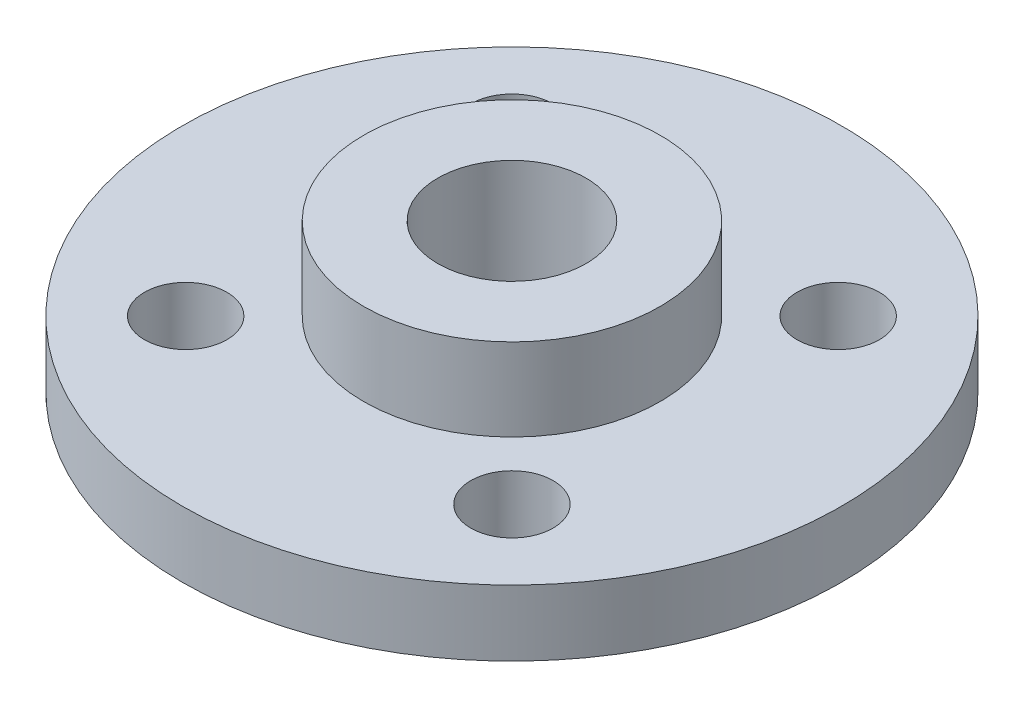
ISO-10303-21;
HEADER;
FILE_DESCRIPTION(('STEP AP214'),'2;1');
FILE_NAME('part.step','',(''),(''),'','','');
FILE_SCHEMA(('AUTOMOTIVE_DESIGN { 1 0 10303 214 1 1 1 1 }'));
ENDSEC;
DATA;
#1=APPLICATION_CONTEXT('core data for automotive mechanical design processes');
#2=APPLICATION_PROTOCOL_DEFINITION('international standard','automotive_design',2000,#1);
#3=PRODUCT_CONTEXT('',#1,'mechanical');
#4=PRODUCT('Part','Part','',(#3));
#5=PRODUCT_RELATED_PRODUCT_CATEGORY('part','',(#4));
#6=PRODUCT_DEFINITION_FORMATION('','',#4);
#7=PRODUCT_DEFINITION_CONTEXT('part definition',#1,'design');
#8=PRODUCT_DEFINITION('design','',#6,#7);
#9=PRODUCT_DEFINITION_SHAPE('','',#8);
#10=(LENGTH_UNIT() NAMED_UNIT(*) SI_UNIT(.MILLI.,.METRE.));
#11=(NAMED_UNIT(*) PLANE_ANGLE_UNIT() SI_UNIT($,.RADIAN.));
#12=(NAMED_UNIT(*) SI_UNIT($,.STERADIAN.) SOLID_ANGLE_UNIT());
#13=UNCERTAINTY_MEASURE_WITH_UNIT(LENGTH_MEASURE(1.E-05),#10,'distance_accuracy_value','');
#14=(GEOMETRIC_REPRESENTATION_CONTEXT(3) GLOBAL_UNCERTAINTY_ASSIGNED_CONTEXT((#13)) GLOBAL_UNIT_ASSIGNED_CONTEXT((#10,
#11,#12)) REPRESENTATION_CONTEXT('',''));
#15=CARTESIAN_POINT('',(0.,0.,0.));
#16=DIRECTION('',(0.,0.,1.));
#17=DIRECTION('',(1.,0.,0.));
#18=AXIS2_PLACEMENT_3D('',#15,#16,#17);
#19=CARTESIAN_POINT('',(0.,2.,0.));
#20=DIRECTION('',(0.,-1.,0.));
#21=DIRECTION('',(0.,0.,-1.));
#22=AXIS2_PLACEMENT_3D('',#19,#20,#21);
#23=CYLINDRICAL_SURFACE('',#22,1.5);
#24=CARTESIAN_POINT('',(0.,0.,0.));
#25=DIRECTION('',(0.,1.,0.));
#26=DIRECTION('',(0.,0.,1.));
#27=AXIS2_PLACEMENT_3D('',#24,#25,#26);
#28=CIRCLE('',#27,1.5);
#29=CARTESIAN_POINT('',(0.,0.,1.5));
#30=VERTEX_POINT('',#29);
#31=EDGE_CURVE('E73',#30,#30,#28,.T.);
#32=ORIENTED_EDGE('',*,*,#31,.F.);
#33=EDGE_LOOP('',(#32));
#34=FACE_BOUND('',#33,.T.);
#35=CARTESIAN_POINT('',(0.,0.900000000000001,0.));
#36=DIRECTION('',(0.,1.,0.));
#37=DIRECTION('',(0.,0.,1.));
#38=AXIS2_PLACEMENT_3D('',#35,#36,#37);
#39=CIRCLE('',#38,1.5);
#40=CARTESIAN_POINT('',(0.,0.900000000000001,1.5));
#41=VERTEX_POINT('',#40);
#42=EDGE_CURVE('E41',#41,#41,#39,.T.);
#43=ORIENTED_EDGE('',*,*,#42,.T.);
#44=EDGE_LOOP('',(#43));
#45=FACE_BOUND('',#44,.T.);
#46=ADVANCED_FACE('F37',(#34,#45),#23,.F.);
#47=CARTESIAN_POINT('',(0.,2.,0.));
#48=DIRECTION('',(0.,1.,0.));
#49=DIRECTION('',(0.,0.,1.));
#50=AXIS2_PLACEMENT_3D('',#47,#48,#49);
#51=PLANE('',#50);
#52=CARTESIAN_POINT('',(4.94974746830583,2.,4.94974746830583));
#53=DIRECTION('',(0.,1.,0.));
#54=DIRECTION('',(0.,0.,1.));
#55=AXIS2_PLACEMENT_3D('',#52,#53,#54);
#56=CIRCLE('',#55,1.25);
#57=CARTESIAN_POINT('',(4.94974746830583,2.,6.19974746830583));
#58=VERTEX_POINT('',#57);
#59=EDGE_CURVE('E61',#58,#58,#56,.T.);
#60=ORIENTED_EDGE('',*,*,#59,.F.);
#61=EDGE_LOOP('',(#60));
#62=FACE_BOUND('',#61,.T.);
#63=CARTESIAN_POINT('',(-4.94974746830583,2.,-4.94974746830583));
#64=DIRECTION('',(0.,1.,0.));
#65=DIRECTION('',(0.,0.,1.));
#66=AXIS2_PLACEMENT_3D('',#63,#64,#65);
#67=CIRCLE('',#66,1.25);
#68=CARTESIAN_POINT('',(-4.94974746830583,2.,-3.69974746830583));
#69=VERTEX_POINT('',#68);
#70=EDGE_CURVE('E50',#69,#69,#67,.T.);
#71=ORIENTED_EDGE('',*,*,#70,.F.);
#72=EDGE_LOOP('',(#71));
#73=FACE_BOUND('',#72,.T.);
#74=CARTESIAN_POINT('',(0.,2.,0.));
#75=DIRECTION('',(0.,1.,0.));
#76=DIRECTION('',(0.,0.,1.));
#77=AXIS2_PLACEMENT_3D('',#74,#75,#76);
#78=CIRCLE('',#77,10.);
#79=CARTESIAN_POINT('',(0.,2.,10.));
#80=VERTEX_POINT('',#79);
#81=EDGE_CURVE('E10',#80,#80,#78,.T.);
#82=ORIENTED_EDGE('',*,*,#81,.T.);
#83=EDGE_LOOP('',(#82));
#84=FACE_BOUND('',#83,.T.);
#85=CARTESIAN_POINT('',(4.94974746830583,2.,-4.94974746830583));
#86=DIRECTION('',(0.,1.,0.));
#87=DIRECTION('',(0.,0.,1.));
#88=AXIS2_PLACEMENT_3D('',#85,#86,#87);
#89=CIRCLE('',#88,1.25);
#90=CARTESIAN_POINT('',(4.94974746830583,2.,-3.69974746830583));
#91=VERTEX_POINT('',#90);
#92=EDGE_CURVE('E55',#91,#91,#89,.T.);
#93=ORIENTED_EDGE('',*,*,#92,.F.);
#94=EDGE_LOOP('',(#93));
#95=FACE_BOUND('',#94,.T.);
#96=CARTESIAN_POINT('',(-4.94974746830583,2.,4.94974746830583));
#97=DIRECTION('',(0.,1.,0.));
#98=DIRECTION('',(0.,0.,1.));
#99=AXIS2_PLACEMENT_3D('',#96,#97,#98);
#100=CIRCLE('',#99,1.25);
#101=CARTESIAN_POINT('',(-4.94974746830583,2.,6.19974746830583));
#102=VERTEX_POINT('',#101);
#103=EDGE_CURVE('E67',#102,#102,#100,.T.);
#104=ORIENTED_EDGE('',*,*,#103,.F.);
#105=EDGE_LOOP('',(#104));
#106=FACE_BOUND('',#105,.T.);
#107=CARTESIAN_POINT('',(0.,2.,0.));
#108=DIRECTION('',(0.,1.,0.));
#109=DIRECTION('',(0.,0.,1.));
#110=AXIS2_PLACEMENT_3D('',#107,#108,#109);
#111=CIRCLE('',#110,4.5);
#112=CARTESIAN_POINT('',(0.,2.,4.5));
#113=VERTEX_POINT('',#112);
#114=EDGE_CURVE('E79',#113,#113,#111,.T.);
#115=ORIENTED_EDGE('',*,*,#114,.F.);
#116=EDGE_LOOP('',(#115));
#117=FACE_BOUND('',#116,.T.);
#118=ADVANCED_FACE('F106',(#62,#73,#84,#95,#106,#117),#51,.T.);
#119=CARTESIAN_POINT('',(0.,0.,0.));
#120=DIRECTION('',(0.,1.,0.));
#121=DIRECTION('',(0.,0.,1.));
#122=AXIS2_PLACEMENT_3D('',#119,#120,#121);
#123=PLANE('',#122);
#124=CARTESIAN_POINT('',(0.,0.,0.));
#125=DIRECTION('',(0.,1.,0.));
#126=DIRECTION('',(0.,0.,1.));
#127=AXIS2_PLACEMENT_3D('',#124,#125,#126);
#128=CIRCLE('',#127,10.);
#129=CARTESIAN_POINT('',(0.,0.,10.));
#130=VERTEX_POINT('',#129);
#131=EDGE_CURVE('E45',#130,#130,#128,.T.);
#132=ORIENTED_EDGE('',*,*,#131,.F.);
#133=EDGE_LOOP('',(#132));
#134=FACE_BOUND('',#133,.T.);
#135=CARTESIAN_POINT('',(-4.94974746830583,0.,-4.94974746830583));
#136=DIRECTION('',(0.,1.,0.));
#137=DIRECTION('',(0.,0.,1.));
#138=AXIS2_PLACEMENT_3D('',#135,#136,#137);
#139=CIRCLE('',#138,1.25);
#140=CARTESIAN_POINT('',(-4.94974746830583,0.,-3.69974746830583));
#141=VERTEX_POINT('',#140);
#142=EDGE_CURVE('E52',#141,#141,#139,.T.);
#143=ORIENTED_EDGE('',*,*,#142,.T.);
#144=EDGE_LOOP('',(#143));
#145=FACE_BOUND('',#144,.T.);
#146=CARTESIAN_POINT('',(4.94974746830583,0.,-4.94974746830583));
#147=DIRECTION('',(0.,1.,0.));
#148=DIRECTION('',(0.,0.,1.));
#149=AXIS2_PLACEMENT_3D('',#146,#147,#148);
#150=CIRCLE('',#149,1.25);
#151=CARTESIAN_POINT('',(4.94974746830583,0.,-3.69974746830583));
#152=VERTEX_POINT('',#151);
#153=EDGE_CURVE('E58',#152,#152,#150,.T.);
#154=ORIENTED_EDGE('',*,*,#153,.T.);
#155=EDGE_LOOP('',(#154));
#156=FACE_BOUND('',#155,.T.);
#157=CARTESIAN_POINT('',(4.94974746830583,0.,4.94974746830583));
#158=DIRECTION('',(0.,1.,0.));
#159=DIRECTION('',(0.,0.,1.));
#160=AXIS2_PLACEMENT_3D('',#157,#158,#159);
#161=CIRCLE('',#160,1.25);
#162=CARTESIAN_POINT('',(4.94974746830583,0.,6.19974746830583));
#163=VERTEX_POINT('',#162);
#164=EDGE_CURVE('E64',#163,#163,#161,.T.);
#165=ORIENTED_EDGE('',*,*,#164,.T.);
#166=EDGE_LOOP('',(#165));
#167=FACE_BOUND('',#166,.T.);
#168=CARTESIAN_POINT('',(-4.94974746830583,0.,4.94974746830583));
#169=DIRECTION('',(0.,1.,0.));
#170=DIRECTION('',(0.,0.,1.));
#171=AXIS2_PLACEMENT_3D('',#168,#169,#170);
#172=CIRCLE('',#171,1.25);
#173=CARTESIAN_POINT('',(-4.94974746830583,0.,6.19974746830583));
#174=VERTEX_POINT('',#173);
#175=EDGE_CURVE('E70',#174,#174,#172,.T.);
#176=ORIENTED_EDGE('',*,*,#175,.T.);
#177=EDGE_LOOP('',(#176));
#178=FACE_BOUND('',#177,.T.);
#179=ORIENTED_EDGE('',*,*,#31,.T.);
#180=EDGE_LOOP('',(#179));
#181=FACE_BOUND('',#180,.T.);
#182=ADVANCED_FACE('F112',(#134,#145,#156,#167,#178,#181),#123,.F.);
#183=CARTESIAN_POINT('',(0.,2.,0.));
#184=DIRECTION('',(0.,-1.,0.));
#185=DIRECTION('',(0.,0.,-1.));
#186=AXIS2_PLACEMENT_3D('',#183,#184,#185);
#187=CYLINDRICAL_SURFACE('',#186,10.);
#188=ORIENTED_EDGE('',*,*,#81,.F.);
#189=EDGE_LOOP('',(#188));
#190=FACE_BOUND('',#189,.T.);
#191=ORIENTED_EDGE('',*,*,#131,.T.);
#192=EDGE_LOOP('',(#191));
#193=FACE_BOUND('',#192,.T.);
#194=ADVANCED_FACE('F39',(#190,#193),#187,.T.);
#195=CARTESIAN_POINT('',(-4.94974746830583,2.,-4.94974746830583));
#196=DIRECTION('',(0.,-1.,0.));
#197=DIRECTION('',(0.,0.,-1.));
#198=AXIS2_PLACEMENT_3D('',#195,#196,#197);
#199=CYLINDRICAL_SURFACE('',#198,1.25);
#200=ORIENTED_EDGE('',*,*,#70,.T.);
#201=EDGE_LOOP('',(#200));
#202=FACE_BOUND('',#201,.T.);
#203=ORIENTED_EDGE('',*,*,#142,.F.);
#204=EDGE_LOOP('',(#203));
#205=FACE_BOUND('',#204,.T.);
#206=ADVANCED_FACE('F131',(#202,#205),#199,.F.);
#207=CARTESIAN_POINT('',(4.94974746830583,2.,-4.94974746830583));
#208=DIRECTION('',(0.,-1.,0.));
#209=DIRECTION('',(0.,0.,-1.));
#210=AXIS2_PLACEMENT_3D('',#207,#208,#209);
#211=CYLINDRICAL_SURFACE('',#210,1.25);
#212=ORIENTED_EDGE('',*,*,#92,.T.);
#213=EDGE_LOOP('',(#212));
#214=FACE_BOUND('',#213,.T.);
#215=ORIENTED_EDGE('',*,*,#153,.F.);
#216=EDGE_LOOP('',(#215));
#217=FACE_BOUND('',#216,.T.);
#218=ADVANCED_FACE('F127',(#214,#217),#211,.F.);
#219=CARTESIAN_POINT('',(4.94974746830583,2.,4.94974746830583));
#220=DIRECTION('',(0.,-1.,0.));
#221=DIRECTION('',(0.,0.,-1.));
#222=AXIS2_PLACEMENT_3D('',#219,#220,#221);
#223=CYLINDRICAL_SURFACE('',#222,1.25);
#224=ORIENTED_EDGE('',*,*,#59,.T.);
#225=EDGE_LOOP('',(#224));
#226=FACE_BOUND('',#225,.T.);
#227=ORIENTED_EDGE('',*,*,#164,.F.);
#228=EDGE_LOOP('',(#227));
#229=FACE_BOUND('',#228,.T.);
#230=ADVANCED_FACE('F123',(#226,#229),#223,.F.);
#231=CARTESIAN_POINT('',(-4.94974746830583,2.,4.94974746830583));
#232=DIRECTION('',(0.,-1.,0.));
#233=DIRECTION('',(0.,0.,-1.));
#234=AXIS2_PLACEMENT_3D('',#231,#232,#233);
#235=CYLINDRICAL_SURFACE('',#234,1.25);
#236=ORIENTED_EDGE('',*,*,#103,.T.);
#237=EDGE_LOOP('',(#236));
#238=FACE_BOUND('',#237,.T.);
#239=ORIENTED_EDGE('',*,*,#175,.F.);
#240=EDGE_LOOP('',(#239));
#241=FACE_BOUND('',#240,.T.);
#242=ADVANCED_FACE('F119',(#238,#241),#235,.F.);
#243=CARTESIAN_POINT('',(0.,4.5,0.));
#244=DIRECTION('',(0.,1.,0.));
#245=DIRECTION('',(0.,0.,1.));
#246=AXIS2_PLACEMENT_3D('',#243,#244,#245);
#247=PLANE('',#246);
#248=CARTESIAN_POINT('',(0.,4.5,0.));
#249=DIRECTION('',(0.,1.,0.));
#250=DIRECTION('',(0.,0.,1.));
#251=AXIS2_PLACEMENT_3D('',#248,#249,#250);
#252=CIRCLE('',#251,2.25);
#253=CARTESIAN_POINT('',(0.,4.5,2.25));
#254=VERTEX_POINT('',#253);
#255=EDGE_CURVE('E84',#254,#254,#252,.T.);
#256=ORIENTED_EDGE('',*,*,#255,.F.);
#257=EDGE_LOOP('',(#256));
#258=FACE_BOUND('',#257,.T.);
#259=CARTESIAN_POINT('',(0.,4.5,0.));
#260=DIRECTION('',(0.,1.,0.));
#261=DIRECTION('',(0.,0.,1.));
#262=AXIS2_PLACEMENT_3D('',#259,#260,#261);
#263=CIRCLE('',#262,4.5);
#264=CARTESIAN_POINT('',(0.,4.5,4.5));
#265=VERTEX_POINT('',#264);
#266=EDGE_CURVE('E78',#265,#265,#263,.T.);
#267=ORIENTED_EDGE('',*,*,#266,.T.);
#268=EDGE_LOOP('',(#267));
#269=FACE_BOUND('',#268,.T.);
#270=ADVANCED_FACE('F122',(#258,#269),#247,.T.);
#271=CARTESIAN_POINT('',(0.,4.5,0.));
#272=DIRECTION('',(0.,-1.,0.));
#273=DIRECTION('',(0.,0.,-1.));
#274=AXIS2_PLACEMENT_3D('',#271,#272,#273);
#275=CYLINDRICAL_SURFACE('',#274,4.5);
#276=ORIENTED_EDGE('',*,*,#266,.F.);
#277=EDGE_LOOP('',(#276));
#278=FACE_BOUND('',#277,.T.);
#279=ORIENTED_EDGE('',*,*,#114,.T.);
#280=EDGE_LOOP('',(#279));
#281=FACE_BOUND('',#280,.T.);
#282=ADVANCED_FACE('F102',(#278,#281),#275,.T.);
#283=CARTESIAN_POINT('',(0.,0.900000000000001,0.));
#284=DIRECTION('',(0.,1.,0.));
#285=DIRECTION('',(0.,0.,1.));
#286=AXIS2_PLACEMENT_3D('',#283,#284,#285);
#287=CYLINDRICAL_SURFACE('',#286,2.25);
#288=CARTESIAN_POINT('',(0.,0.900000000000001,0.));
#289=DIRECTION('',(0.,1.,0.));
#290=DIRECTION('',(0.,0.,1.));
#291=AXIS2_PLACEMENT_3D('',#288,#289,#290);
#292=CIRCLE('',#291,2.25);
#293=CARTESIAN_POINT('',(0.,0.900000000000001,2.25));
#294=VERTEX_POINT('',#293);
#295=EDGE_CURVE('E87',#294,#294,#292,.T.);
#296=ORIENTED_EDGE('',*,*,#295,.F.);
#297=EDGE_LOOP('',(#296));
#298=FACE_BOUND('',#297,.T.);
#299=ORIENTED_EDGE('',*,*,#255,.T.);
#300=EDGE_LOOP('',(#299));
#301=FACE_BOUND('',#300,.T.);
#302=ADVANCED_FACE('F97',(#298,#301),#287,.F.);
#303=CARTESIAN_POINT('',(0.,0.900000000000001,0.));
#304=DIRECTION('',(0.,1.,0.));
#305=DIRECTION('',(0.,0.,1.));
#306=AXIS2_PLACEMENT_3D('',#303,#304,#305);
#307=PLANE('',#306);
#308=ORIENTED_EDGE('',*,*,#42,.F.);
#309=EDGE_LOOP('',(#308));
#310=FACE_BOUND('',#309,.T.);
#311=ORIENTED_EDGE('',*,*,#295,.T.);
#312=EDGE_LOOP('',(#311));
#313=FACE_BOUND('',#312,.T.);
#314=ADVANCED_FACE('F95',(#310,#313),#307,.T.);
#315=CLOSED_SHELL('',(#46,#118,#182,#194,#206,#218,#230,#242,#270,#282,#302,#314));
#316=MANIFOLD_SOLID_BREP('B2',#315);
#317=ADVANCED_BREP_SHAPE_REPRESENTATION('',(#18,#316),#14);
#318=SHAPE_DEFINITION_REPRESENTATION(#9,#317);
ENDSEC;
END-ISO-10303-21;
